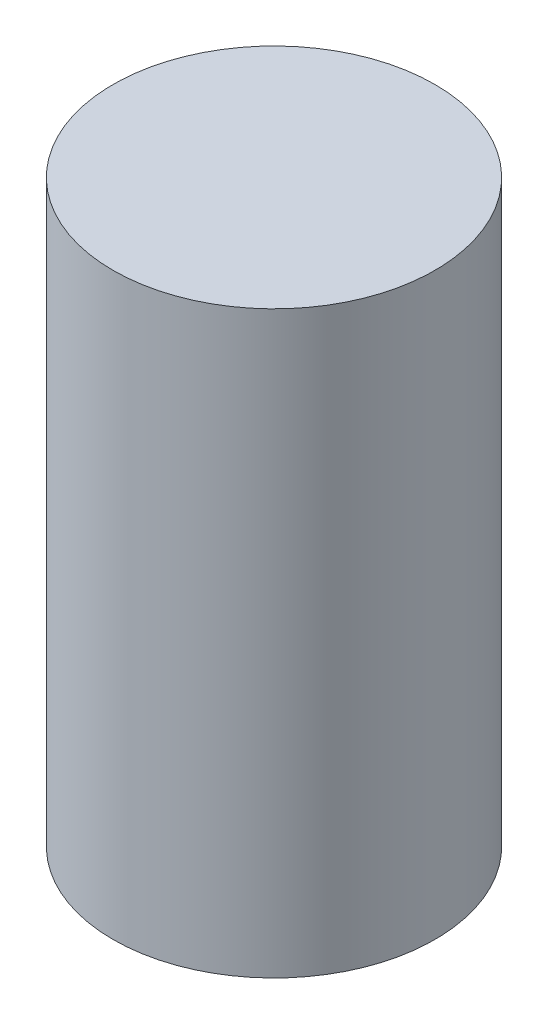
ISO-10303-21;
HEADER;
FILE_DESCRIPTION(('STEP AP214'),'2;1');
FILE_NAME('part.step','',(''),(''),'','','');
FILE_SCHEMA(('AUTOMOTIVE_DESIGN { 1 0 10303 214 1 1 1 1 }'));
ENDSEC;
DATA;
#1=APPLICATION_CONTEXT('core data for automotive mechanical design processes');
#2=APPLICATION_PROTOCOL_DEFINITION('international standard','automotive_design',2000,#1);
#3=PRODUCT_CONTEXT('',#1,'mechanical');
#4=PRODUCT('Part','Part','',(#3));
#5=PRODUCT_RELATED_PRODUCT_CATEGORY('part','',(#4));
#6=PRODUCT_DEFINITION_FORMATION('','',#4);
#7=PRODUCT_DEFINITION_CONTEXT('part definition',#1,'design');
#8=PRODUCT_DEFINITION('design','',#6,#7);
#9=PRODUCT_DEFINITION_SHAPE('','',#8);
#10=(LENGTH_UNIT() NAMED_UNIT(*) SI_UNIT(.MILLI.,.METRE.));
#11=(NAMED_UNIT(*) PLANE_ANGLE_UNIT() SI_UNIT($,.RADIAN.));
#12=(NAMED_UNIT(*) SI_UNIT($,.STERADIAN.) SOLID_ANGLE_UNIT());
#13=UNCERTAINTY_MEASURE_WITH_UNIT(LENGTH_MEASURE(1.E-05),#10,'distance_accuracy_value','');
#14=(GEOMETRIC_REPRESENTATION_CONTEXT(3) GLOBAL_UNCERTAINTY_ASSIGNED_CONTEXT((#13)) GLOBAL_UNIT_ASSIGNED_CONTEXT((#10,
#11,#12)) REPRESENTATION_CONTEXT('',''));
#15=CARTESIAN_POINT('',(0.,0.,0.));
#16=DIRECTION('',(0.,0.,1.));
#17=DIRECTION('',(1.,0.,0.));
#18=AXIS2_PLACEMENT_3D('',#15,#16,#17);
#19=CARTESIAN_POINT('',(0.,4.5,0.));
#20=DIRECTION('',(0.,-1.,0.));
#21=DIRECTION('',(0.,0.,-1.));
#22=AXIS2_PLACEMENT_3D('',#19,#20,#21);
#23=CYLINDRICAL_SURFACE('',#22,1.25);
#24=CARTESIAN_POINT('',(0.,4.5,0.));
#25=DIRECTION('',(0.,1.,0.));
#26=DIRECTION('',(0.,0.,1.));
#27=AXIS2_PLACEMENT_3D('',#24,#25,#26);
#28=CIRCLE('',#27,1.25);
#29=CARTESIAN_POINT('',(0.,4.5,1.25));
#30=VERTEX_POINT('',#29);
#31=EDGE_CURVE('E10',#30,#30,#28,.T.);
#32=ORIENTED_EDGE('',*,*,#31,.F.);
#33=EDGE_LOOP('',(#32));
#34=FACE_BOUND('',#33,.T.);
#35=CARTESIAN_POINT('',(0.,0.,0.));
#36=DIRECTION('',(0.,1.,0.));
#37=DIRECTION('',(0.,0.,1.));
#38=AXIS2_PLACEMENT_3D('',#35,#36,#37);
#39=CIRCLE('',#38,1.25);
#40=CARTESIAN_POINT('',(0.,0.,1.25));
#41=VERTEX_POINT('',#40);
#42=EDGE_CURVE('E38',#41,#41,#39,.T.);
#43=ORIENTED_EDGE('',*,*,#42,.T.);
#44=EDGE_LOOP('',(#43));
#45=FACE_BOUND('',#44,.T.);
#46=ADVANCED_FACE('F35',(#34,#45),#23,.T.);
#47=CARTESIAN_POINT('',(0.,4.5,0.));
#48=DIRECTION('',(0.,1.,0.));
#49=DIRECTION('',(0.,0.,1.));
#50=AXIS2_PLACEMENT_3D('',#47,#48,#49);
#51=PLANE('',#50);
#52=ORIENTED_EDGE('',*,*,#31,.T.);
#53=EDGE_LOOP('',(#52));
#54=FACE_BOUND('',#53,.T.);
#55=ADVANCED_FACE('F52',(#54),#51,.T.);
#56=CARTESIAN_POINT('',(0.,0.,0.));
#57=DIRECTION('',(0.,1.,0.));
#58=DIRECTION('',(0.,0.,1.));
#59=AXIS2_PLACEMENT_3D('',#56,#57,#58);
#60=PLANE('',#59);
#61=ORIENTED_EDGE('',*,*,#42,.F.);
#62=EDGE_LOOP('',(#61));
#63=FACE_BOUND('',#62,.T.);
#64=ADVANCED_FACE('F50',(#63),#60,.F.);
#65=CLOSED_SHELL('',(#46,#55,#64));
#66=MANIFOLD_SOLID_BREP('B2',#65);
#67=ADVANCED_BREP_SHAPE_REPRESENTATION('',(#18,#66),#14);
#68=SHAPE_DEFINITION_REPRESENTATION(#9,#67);
ENDSEC;
END-ISO-10303-21;
